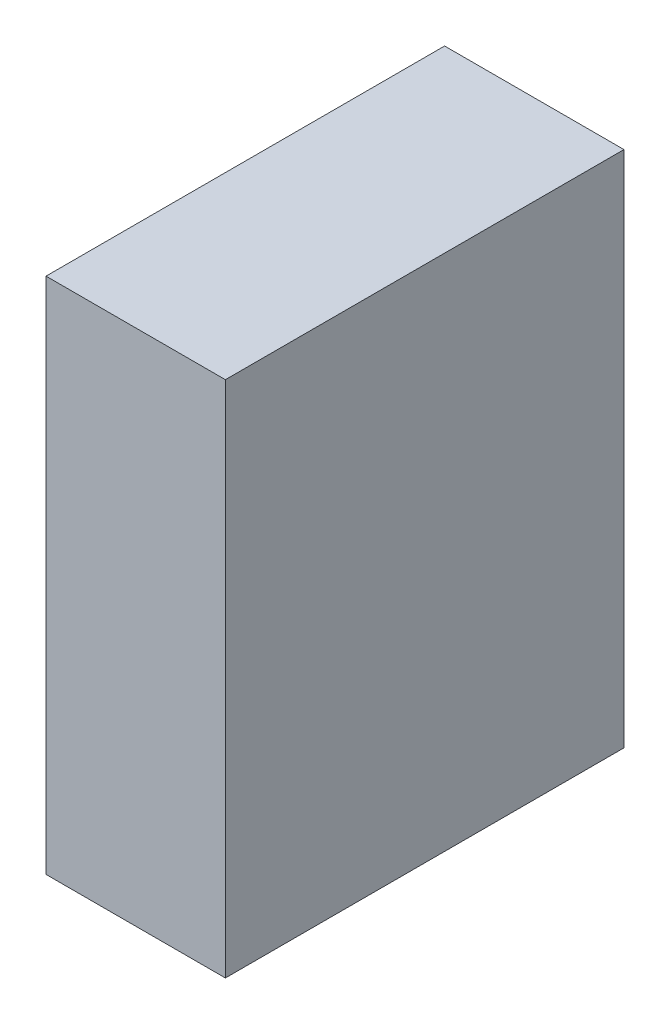
ISO-10303-21;
HEADER;
FILE_DESCRIPTION(('STEP AP214'),'2;1');
FILE_NAME('part.step','',(''),(''),'','','');
FILE_SCHEMA(('AUTOMOTIVE_DESIGN { 1 0 10303 214 1 1 1 1 }'));
ENDSEC;
DATA;
#1=APPLICATION_CONTEXT('core data for automotive mechanical design processes');
#2=APPLICATION_PROTOCOL_DEFINITION('international standard','automotive_design',2000,#1);
#3=PRODUCT_CONTEXT('',#1,'mechanical');
#4=PRODUCT('Part','Part','',(#3));
#5=PRODUCT_RELATED_PRODUCT_CATEGORY('part','',(#4));
#6=PRODUCT_DEFINITION_FORMATION('','',#4);
#7=PRODUCT_DEFINITION_CONTEXT('part definition',#1,'design');
#8=PRODUCT_DEFINITION('design','',#6,#7);
#9=PRODUCT_DEFINITION_SHAPE('','',#8);
#10=(LENGTH_UNIT() NAMED_UNIT(*) SI_UNIT(.MILLI.,.METRE.));
#11=(NAMED_UNIT(*) PLANE_ANGLE_UNIT() SI_UNIT($,.RADIAN.));
#12=(NAMED_UNIT(*) SI_UNIT($,.STERADIAN.) SOLID_ANGLE_UNIT());
#13=UNCERTAINTY_MEASURE_WITH_UNIT(LENGTH_MEASURE(1.E-05),#10,'distance_accuracy_value','');
#14=(GEOMETRIC_REPRESENTATION_CONTEXT(3) GLOBAL_UNCERTAINTY_ASSIGNED_CONTEXT((#13)) GLOBAL_UNIT_ASSIGNED_CONTEXT((#10,
#11,#12)) REPRESENTATION_CONTEXT('',''));
#15=CARTESIAN_POINT('',(0.,0.,0.));
#16=DIRECTION('',(0.,0.,1.));
#17=DIRECTION('',(1.,0.,0.));
#18=AXIS2_PLACEMENT_3D('',#15,#16,#17);
#19=CARTESIAN_POINT('',(57.15,-165.1,-127.));
#20=DIRECTION('',(0.,0.,1.));
#21=DIRECTION('',(1.,0.,0.));
#22=AXIS2_PLACEMENT_3D('',#19,#20,#21);
#23=PLANE('',#22);
#24=DIRECTION('',(0.,1.,0.));
#25=VECTOR('',#24,1.);
#26=CARTESIAN_POINT('',(-57.15,-165.1,-127.));
#27=LINE('',#26,#25);
#28=CARTESIAN_POINT('',(-57.15,-165.1,-127.));
#29=VERTEX_POINT('',#28);
#30=CARTESIAN_POINT('',(-57.15,165.1,-127.));
#31=VERTEX_POINT('',#30);
#32=EDGE_CURVE('E100',#29,#31,#27,.T.);
#33=ORIENTED_EDGE('',*,*,#32,.T.);
#34=DIRECTION('',(-1.,0.,0.));
#35=VECTOR('',#34,1.);
#36=CARTESIAN_POINT('',(57.15,165.1,-127.));
#37=LINE('',#36,#35);
#38=CARTESIAN_POINT('',(57.15,165.1,-127.));
#39=VERTEX_POINT('',#38);
#40=EDGE_CURVE('E11',#39,#31,#37,.T.);
#41=ORIENTED_EDGE('',*,*,#40,.F.);
#42=DIRECTION('',(0.,1.,0.));
#43=VECTOR('',#42,1.);
#44=CARTESIAN_POINT('',(57.15,-165.1,-127.));
#45=LINE('',#44,#43);
#46=CARTESIAN_POINT('',(57.15,-165.1,-127.));
#47=VERTEX_POINT('',#46);
#48=EDGE_CURVE('E88',#47,#39,#45,.T.);
#49=ORIENTED_EDGE('',*,*,#48,.F.);
#50=DIRECTION('',(-1.,0.,0.));
#51=VECTOR('',#50,1.);
#52=CARTESIAN_POINT('',(57.15,-165.1,-127.));
#53=LINE('',#52,#51);
#54=EDGE_CURVE('E96',#47,#29,#53,.T.);
#55=ORIENTED_EDGE('',*,*,#54,.T.);
#56=EDGE_LOOP('',(#33,#41,#49,#55));
#57=FACE_BOUND('',#56,.T.);
#58=ADVANCED_FACE('F37',(#57),#23,.F.);
#59=CARTESIAN_POINT('',(57.15,165.1,127.));
#60=DIRECTION('',(0.,-1.,0.));
#61=DIRECTION('',(0.,0.,-1.));
#62=AXIS2_PLACEMENT_3D('',#59,#60,#61);
#63=PLANE('',#62);
#64=DIRECTION('',(0.,0.,1.));
#65=VECTOR('',#64,1.);
#66=CARTESIAN_POINT('',(-57.15,165.1,127.));
#67=LINE('',#66,#65);
#68=CARTESIAN_POINT('',(-57.15,165.1,127.));
#69=VERTEX_POINT('',#68);
#70=EDGE_CURVE('E92',#31,#69,#67,.T.);
#71=ORIENTED_EDGE('',*,*,#70,.T.);
#72=DIRECTION('',(-1.,0.,0.));
#73=VECTOR('',#72,1.);
#74=CARTESIAN_POINT('',(57.15,165.1,127.));
#75=LINE('',#74,#73);
#76=CARTESIAN_POINT('',(57.15,165.1,127.));
#77=VERTEX_POINT('',#76);
#78=EDGE_CURVE('E45',#77,#69,#75,.T.);
#79=ORIENTED_EDGE('',*,*,#78,.F.);
#80=DIRECTION('',(0.,0.,1.));
#81=VECTOR('',#80,1.);
#82=CARTESIAN_POINT('',(57.15,165.1,127.));
#83=LINE('',#82,#81);
#84=EDGE_CURVE('E83',#39,#77,#83,.T.);
#85=ORIENTED_EDGE('',*,*,#84,.F.);
#86=ORIENTED_EDGE('',*,*,#40,.T.);
#87=EDGE_LOOP('',(#71,#79,#85,#86));
#88=FACE_BOUND('',#87,.T.);
#89=ADVANCED_FACE('F91',(#88),#63,.F.);
#90=CARTESIAN_POINT('',(57.15,-165.1,127.));
#91=DIRECTION('',(0.,0.,-1.));
#92=DIRECTION('',(-1.,0.,0.));
#93=AXIS2_PLACEMENT_3D('',#90,#91,#92);
#94=PLANE('',#93);
#95=DIRECTION('',(0.,-1.,0.));
#96=VECTOR('',#95,1.);
#97=CARTESIAN_POINT('',(-57.15,-165.1,127.));
#98=LINE('',#97,#96);
#99=CARTESIAN_POINT('',(-57.15,-165.1,127.));
#100=VERTEX_POINT('',#99);
#101=EDGE_CURVE('E70',#69,#100,#98,.T.);
#102=ORIENTED_EDGE('',*,*,#101,.T.);
#103=DIRECTION('',(-1.,0.,0.));
#104=VECTOR('',#103,1.);
#105=CARTESIAN_POINT('',(57.15,-165.1,127.));
#106=LINE('',#105,#104);
#107=CARTESIAN_POINT('',(57.15,-165.1,127.));
#108=VERTEX_POINT('',#107);
#109=EDGE_CURVE('E93',#108,#100,#106,.T.);
#110=ORIENTED_EDGE('',*,*,#109,.F.);
#111=DIRECTION('',(0.,-1.,0.));
#112=VECTOR('',#111,1.);
#113=CARTESIAN_POINT('',(57.15,-165.1,127.));
#114=LINE('',#113,#112);
#115=EDGE_CURVE('E86',#77,#108,#114,.T.);
#116=ORIENTED_EDGE('',*,*,#115,.F.);
#117=ORIENTED_EDGE('',*,*,#78,.T.);
#118=EDGE_LOOP('',(#102,#110,#116,#117));
#119=FACE_BOUND('',#118,.T.);
#120=ADVANCED_FACE('F94',(#119),#94,.F.);
#121=CARTESIAN_POINT('',(57.15,-165.1,127.));
#122=DIRECTION('',(0.,1.,0.));
#123=DIRECTION('',(0.,0.,1.));
#124=AXIS2_PLACEMENT_3D('',#121,#122,#123);
#125=PLANE('',#124);
#126=DIRECTION('',(0.,0.,-1.));
#127=VECTOR('',#126,1.);
#128=CARTESIAN_POINT('',(-57.15,-165.1,127.));
#129=LINE('',#128,#127);
#130=EDGE_CURVE('E76',#100,#29,#129,.T.);
#131=ORIENTED_EDGE('',*,*,#130,.T.);
#132=ORIENTED_EDGE('',*,*,#54,.F.);
#133=DIRECTION('',(0.,0.,-1.));
#134=VECTOR('',#133,1.);
#135=CARTESIAN_POINT('',(57.15,-165.1,127.));
#136=LINE('',#135,#134);
#137=EDGE_CURVE('E53',#108,#47,#136,.T.);
#138=ORIENTED_EDGE('',*,*,#137,.F.);
#139=ORIENTED_EDGE('',*,*,#109,.T.);
#140=EDGE_LOOP('',(#131,#132,#138,#139));
#141=FACE_BOUND('',#140,.T.);
#142=ADVANCED_FACE('F107',(#141),#125,.F.);
#143=CARTESIAN_POINT('',(57.15,0.,0.));
#144=DIRECTION('',(-1.,0.,0.));
#145=DIRECTION('',(0.,0.,1.));
#146=AXIS2_PLACEMENT_3D('',#143,#144,#145);
#147=PLANE('',#146);
#148=ORIENTED_EDGE('',*,*,#48,.T.);
#149=ORIENTED_EDGE('',*,*,#84,.T.);
#150=ORIENTED_EDGE('',*,*,#115,.T.);
#151=ORIENTED_EDGE('',*,*,#137,.T.);
#152=EDGE_LOOP('',(#148,#149,#150,#151));
#153=FACE_BOUND('',#152,.T.);
#154=ADVANCED_FACE('F84',(#153),#147,.F.);
#155=CARTESIAN_POINT('',(-57.15,0.,0.));
#156=DIRECTION('',(-1.,0.,0.));
#157=DIRECTION('',(0.,0.,1.));
#158=AXIS2_PLACEMENT_3D('',#155,#156,#157);
#159=PLANE('',#158);
#160=ORIENTED_EDGE('',*,*,#32,.F.);
#161=ORIENTED_EDGE('',*,*,#130,.F.);
#162=ORIENTED_EDGE('',*,*,#101,.F.);
#163=ORIENTED_EDGE('',*,*,#70,.F.);
#164=EDGE_LOOP('',(#160,#161,#162,#163));
#165=FACE_BOUND('',#164,.T.);
#166=ADVANCED_FACE('F110',(#165),#159,.T.);
#167=CLOSED_SHELL('',(#58,#89,#120,#142,#154,#166));
#168=MANIFOLD_SOLID_BREP('B2',#167);
#169=ADVANCED_BREP_SHAPE_REPRESENTATION('',(#18,#168),#14);
#170=SHAPE_DEFINITION_REPRESENTATION(#9,#169);
ENDSEC;
END-ISO-10303-21;
